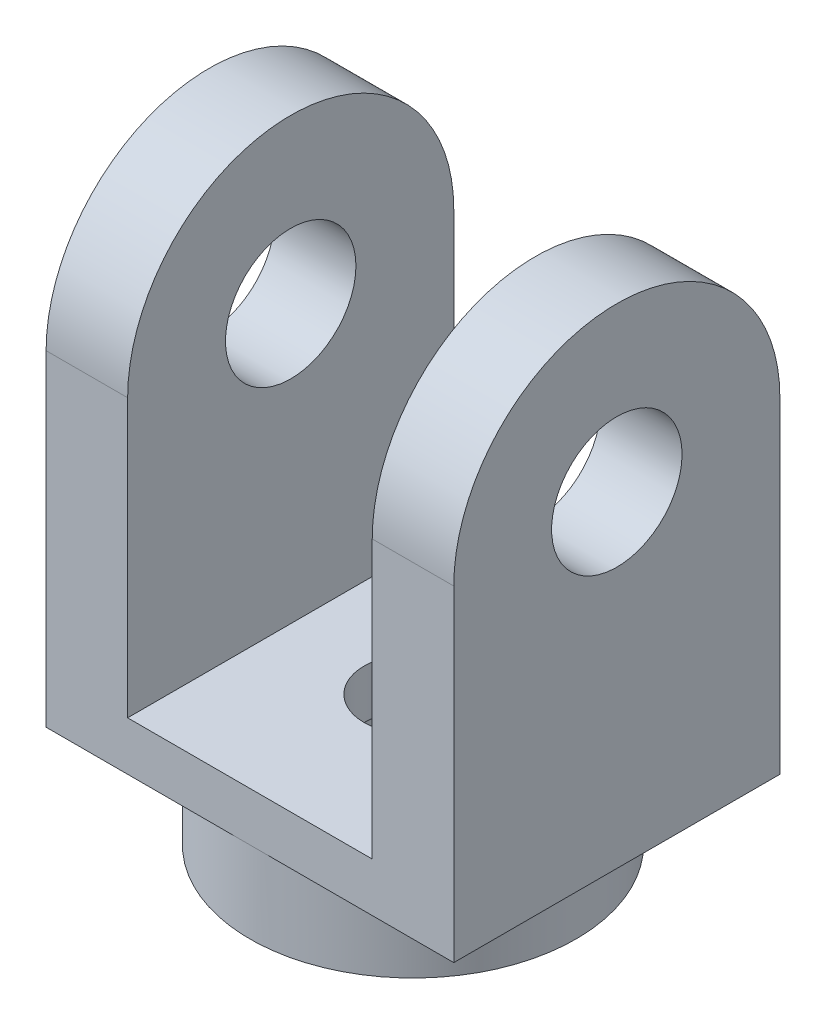
ISO-10303-21;
HEADER;
FILE_DESCRIPTION(('STEP AP214'),'2;1');
FILE_NAME('part.step','',(''),(''),'','','');
FILE_SCHEMA(('AUTOMOTIVE_DESIGN { 1 0 10303 214 1 1 1 1 }'));
ENDSEC;
DATA;
#1=APPLICATION_CONTEXT('core data for automotive mechanical design processes');
#2=APPLICATION_PROTOCOL_DEFINITION('international standard','automotive_design',2000,#1);
#3=PRODUCT_CONTEXT('',#1,'mechanical');
#4=PRODUCT('Part','Part','',(#3));
#5=PRODUCT_RELATED_PRODUCT_CATEGORY('part','',(#4));
#6=PRODUCT_DEFINITION_FORMATION('','',#4);
#7=PRODUCT_DEFINITION_CONTEXT('part definition',#1,'design');
#8=PRODUCT_DEFINITION('design','',#6,#7);
#9=PRODUCT_DEFINITION_SHAPE('','',#8);
#10=(LENGTH_UNIT() NAMED_UNIT(*) SI_UNIT(.MILLI.,.METRE.));
#11=(NAMED_UNIT(*) PLANE_ANGLE_UNIT() SI_UNIT($,.RADIAN.));
#12=(NAMED_UNIT(*) SI_UNIT($,.STERADIAN.) SOLID_ANGLE_UNIT());
#13=UNCERTAINTY_MEASURE_WITH_UNIT(LENGTH_MEASURE(1.E-05),#10,'distance_accuracy_value','');
#14=(GEOMETRIC_REPRESENTATION_CONTEXT(3) GLOBAL_UNCERTAINTY_ASSIGNED_CONTEXT((#13)) GLOBAL_UNIT_ASSIGNED_CONTEXT((#10,
#11,#12)) REPRESENTATION_CONTEXT('',''));
#15=CARTESIAN_POINT('',(0.,0.,0.));
#16=DIRECTION('',(0.,0.,1.));
#17=DIRECTION('',(1.,0.,0.));
#18=AXIS2_PLACEMENT_3D('',#15,#16,#17);
#19=CARTESIAN_POINT('',(0.,15.,0.));
#20=DIRECTION('',(0.,1.,0.));
#21=DIRECTION('',(0.,0.,1.));
#22=AXIS2_PLACEMENT_3D('',#19,#20,#21);
#23=PLANE('',#22);
#24=CARTESIAN_POINT('',(0.,15.,0.));
#25=DIRECTION('',(0.,1.,0.));
#26=DIRECTION('',(0.,0.,1.));
#27=AXIS2_PLACEMENT_3D('',#24,#25,#26);
#28=CIRCLE('',#27,15.);
#29=CARTESIAN_POINT('',(0.,15.,15.));
#30=VERTEX_POINT('',#29);
#31=EDGE_CURVE('E146',#30,#30,#28,.F.);
#32=ORIENTED_EDGE('',*,*,#31,.T.);
#33=EDGE_LOOP('',(#32));
#34=FACE_BOUND('',#33,.T.);
#35=DIRECTION('',(-1.,0.,0.));
#36=VECTOR('',#35,1.);
#37=CARTESIAN_POINT('',(-62.5,15.,-50.));
#38=LINE('',#37,#36);
#39=CARTESIAN_POINT('',(37.5,15.,-50.));
#40=VERTEX_POINT('',#39);
#41=CARTESIAN_POINT('',(-37.5,15.,-50.));
#42=VERTEX_POINT('',#41);
#43=EDGE_CURVE('E64',#40,#42,#38,.T.);
#44=ORIENTED_EDGE('',*,*,#43,.T.);
#45=DIRECTION('',(0.,0.,1.));
#46=VECTOR('',#45,1.);
#47=CARTESIAN_POINT('',(-37.5,15.,0.));
#48=LINE('',#47,#46);
#49=CARTESIAN_POINT('',(-37.5,15.,50.));
#50=VERTEX_POINT('',#49);
#51=EDGE_CURVE('E59',#42,#50,#48,.T.);
#52=ORIENTED_EDGE('',*,*,#51,.T.);
#53=DIRECTION('',(1.,0.,0.));
#54=VECTOR('',#53,1.);
#55=CARTESIAN_POINT('',(-62.5,15.,50.));
#56=LINE('',#55,#54);
#57=CARTESIAN_POINT('',(37.5,15.,50.));
#58=VERTEX_POINT('',#57);
#59=EDGE_CURVE('E213',#50,#58,#56,.T.);
#60=ORIENTED_EDGE('',*,*,#59,.T.);
#61=DIRECTION('',(0.,0.,1.));
#62=VECTOR('',#61,1.);
#63=CARTESIAN_POINT('',(37.5,15.,0.));
#64=LINE('',#63,#62);
#65=EDGE_CURVE('E170',#40,#58,#64,.T.);
#66=ORIENTED_EDGE('',*,*,#65,.F.);
#67=EDGE_LOOP('',(#44,#52,#60,#66));
#68=FACE_BOUND('',#67,.T.);
#69=ADVANCED_FACE('F41',(#34,#68),#23,.T.);
#70=CARTESIAN_POINT('',(0.,0.,0.));
#71=DIRECTION('',(0.,1.,0.));
#72=DIRECTION('',(0.,0.,1.));
#73=AXIS2_PLACEMENT_3D('',#70,#71,#72);
#74=PLANE('',#73);
#75=CARTESIAN_POINT('',(0.,0.,0.));
#76=DIRECTION('',(0.,-1.,0.));
#77=DIRECTION('',(0.,0.,-1.));
#78=AXIS2_PLACEMENT_3D('',#75,#76,#77);
#79=CIRCLE('',#78,50.);
#80=CARTESIAN_POINT('',(0.,0.,-50.));
#81=VERTEX_POINT('',#80);
#82=CARTESIAN_POINT('',(0.,0.,50.));
#83=VERTEX_POINT('',#82);
#84=EDGE_CURVE('E52',#81,#83,#79,.T.);
#85=ORIENTED_EDGE('',*,*,#84,.F.);
#86=DIRECTION('',(-1.,0.,0.));
#87=VECTOR('',#86,1.);
#88=CARTESIAN_POINT('',(-62.5,0.,-50.));
#89=LINE('',#88,#87);
#90=CARTESIAN_POINT('',(62.5,0.,-50.));
#91=VERTEX_POINT('',#90);
#92=EDGE_CURVE('E222',#91,#81,#89,.T.);
#93=ORIENTED_EDGE('',*,*,#92,.F.);
#94=DIRECTION('',(0.,0.,-1.));
#95=VECTOR('',#94,1.);
#96=CARTESIAN_POINT('',(62.5,0.,-50.));
#97=LINE('',#96,#95);
#98=CARTESIAN_POINT('',(62.5,0.,50.));
#99=VERTEX_POINT('',#98);
#100=EDGE_CURVE('E207',#99,#91,#97,.T.);
#101=ORIENTED_EDGE('',*,*,#100,.F.);
#102=DIRECTION('',(1.,0.,0.));
#103=VECTOR('',#102,1.);
#104=CARTESIAN_POINT('',(-62.5,0.,50.));
#105=LINE('',#104,#103);
#106=EDGE_CURVE('E228',#83,#99,#105,.T.);
#107=ORIENTED_EDGE('',*,*,#106,.F.);
#108=EDGE_LOOP('',(#85,#93,#101,#107));
#109=FACE_BOUND('',#108,.T.);
#110=ADVANCED_FACE('F249',(#109),#74,.F.);
#111=CARTESIAN_POINT('',(62.5,15.,-50.));
#112=DIRECTION('',(-1.,0.,0.));
#113=DIRECTION('',(0.,0.,1.));
#114=AXIS2_PLACEMENT_3D('',#111,#112,#113);
#115=PLANE('',#114);
#116=DIRECTION('',(0.,-1.,0.));
#117=VECTOR('',#116,1.);
#118=CARTESIAN_POINT('',(62.5,15.,50.));
#119=LINE('',#118,#117);
#120=CARTESIAN_POINT('',(62.5,100.,50.));
#121=VERTEX_POINT('',#120);
#122=EDGE_CURVE('E217',#121,#99,#119,.T.);
#123=ORIENTED_EDGE('',*,*,#122,.T.);
#124=ORIENTED_EDGE('',*,*,#100,.T.);
#125=DIRECTION('',(0.,-1.,0.));
#126=VECTOR('',#125,1.);
#127=CARTESIAN_POINT('',(62.5,15.,-50.));
#128=LINE('',#127,#126);
#129=CARTESIAN_POINT('',(62.5,100.,-50.));
#130=VERTEX_POINT('',#129);
#131=EDGE_CURVE('E45',#130,#91,#128,.T.);
#132=ORIENTED_EDGE('',*,*,#131,.F.);
#133=CARTESIAN_POINT('',(62.5,100.,0.));
#134=DIRECTION('',(1.,0.,0.));
#135=DIRECTION('',(0.,0.,-1.));
#136=AXIS2_PLACEMENT_3D('',#133,#134,#135);
#137=CIRCLE('',#136,50.);
#138=EDGE_CURVE('E160',#121,#130,#137,.F.);
#139=ORIENTED_EDGE('',*,*,#138,.F.);
#140=EDGE_LOOP('',(#123,#124,#132,#139));
#141=FACE_BOUND('',#140,.T.);
#142=CARTESIAN_POINT('',(62.5,100.,0.));
#143=DIRECTION('',(1.,0.,0.));
#144=DIRECTION('',(0.,0.,-1.));
#145=AXIS2_PLACEMENT_3D('',#142,#143,#144);
#146=CIRCLE('',#145,20.);
#147=CARTESIAN_POINT('',(62.5,100.,-20.));
#148=VERTEX_POINT('',#147);
#149=EDGE_CURVE('E167',#148,#148,#146,.T.);
#150=ORIENTED_EDGE('',*,*,#149,.F.);
#151=EDGE_LOOP('',(#150));
#152=FACE_BOUND('',#151,.T.);
#153=ADVANCED_FACE('F43',(#141,#152),#115,.F.);
#154=CARTESIAN_POINT('',(-62.5,15.,-50.));
#155=DIRECTION('',(0.,0.,1.));
#156=DIRECTION('',(1.,0.,0.));
#157=AXIS2_PLACEMENT_3D('',#154,#155,#156);
#158=PLANE('',#157);
#159=ORIENTED_EDGE('',*,*,#131,.T.);
#160=ORIENTED_EDGE('',*,*,#92,.T.);
#161=CARTESIAN_POINT('',(-62.5,0.,-50.));
#162=VERTEX_POINT('',#161);
#163=EDGE_CURVE('E221',#81,#162,#89,.T.);
#164=ORIENTED_EDGE('',*,*,#163,.T.);
#165=DIRECTION('',(0.,-1.,0.));
#166=VECTOR('',#165,1.);
#167=CARTESIAN_POINT('',(-62.5,15.,-50.));
#168=LINE('',#167,#166);
#169=CARTESIAN_POINT('',(-62.5,100.,-50.));
#170=VERTEX_POINT('',#169);
#171=EDGE_CURVE('E118',#170,#162,#168,.T.);
#172=ORIENTED_EDGE('',*,*,#171,.F.);
#173=DIRECTION('',(-1.,0.,0.));
#174=VECTOR('',#173,1.);
#175=CARTESIAN_POINT('',(-37.5,100.,-50.));
#176=LINE('',#175,#174);
#177=CARTESIAN_POINT('',(-37.5,100.,-50.));
#178=VERTEX_POINT('',#177);
#179=EDGE_CURVE('E113',#178,#170,#176,.T.);
#180=ORIENTED_EDGE('',*,*,#179,.F.);
#181=DIRECTION('',(0.,-1.,0.));
#182=VECTOR('',#181,1.);
#183=CARTESIAN_POINT('',(-37.5,0.,-50.));
#184=LINE('',#183,#182);
#185=EDGE_CURVE('E116',#178,#42,#184,.T.);
#186=ORIENTED_EDGE('',*,*,#185,.T.);
#187=ORIENTED_EDGE('',*,*,#43,.F.);
#188=DIRECTION('',(0.,-1.,0.));
#189=VECTOR('',#188,1.);
#190=CARTESIAN_POINT('',(37.5,0.,-50.));
#191=LINE('',#190,#189);
#192=CARTESIAN_POINT('',(37.5,100.,-50.));
#193=VERTEX_POINT('',#192);
#194=EDGE_CURVE('E174',#193,#40,#191,.T.);
#195=ORIENTED_EDGE('',*,*,#194,.F.);
#196=DIRECTION('',(1.,0.,0.));
#197=VECTOR('',#196,1.);
#198=CARTESIAN_POINT('',(37.5,100.,-50.));
#199=LINE('',#198,#197);
#200=EDGE_CURVE('E189',#193,#130,#199,.T.);
#201=ORIENTED_EDGE('',*,*,#200,.T.);
#202=EDGE_LOOP('',(#159,#160,#164,#172,#180,#186,#187,#195,#201));
#203=FACE_BOUND('',#202,.T.);
#204=ADVANCED_FACE('F115',(#203),#158,.F.);
#205=CARTESIAN_POINT('',(-62.5,15.,-50.));
#206=DIRECTION('',(1.,0.,0.));
#207=DIRECTION('',(0.,0.,-1.));
#208=AXIS2_PLACEMENT_3D('',#205,#206,#207);
#209=PLANE('',#208);
#210=DIRECTION('',(0.,0.,1.));
#211=VECTOR('',#210,1.);
#212=CARTESIAN_POINT('',(-62.5,0.,-50.));
#213=LINE('',#212,#211);
#214=CARTESIAN_POINT('',(-62.5,0.,50.));
#215=VERTEX_POINT('',#214);
#216=EDGE_CURVE('E225',#162,#215,#213,.T.);
#217=ORIENTED_EDGE('',*,*,#216,.T.);
#218=DIRECTION('',(0.,-1.,0.));
#219=VECTOR('',#218,1.);
#220=CARTESIAN_POINT('',(-62.5,15.,50.));
#221=LINE('',#220,#219);
#222=CARTESIAN_POINT('',(-62.5,100.,50.));
#223=VERTEX_POINT('',#222);
#224=EDGE_CURVE('E234',#223,#215,#221,.T.);
#225=ORIENTED_EDGE('',*,*,#224,.F.);
#226=CARTESIAN_POINT('',(-62.5,100.,0.));
#227=DIRECTION('',(1.,0.,0.));
#228=DIRECTION('',(0.,0.,-1.));
#229=AXIS2_PLACEMENT_3D('',#226,#227,#228);
#230=CIRCLE('',#229,50.);
#231=EDGE_CURVE('E143',#223,#170,#230,.F.);
#232=ORIENTED_EDGE('',*,*,#231,.T.);
#233=ORIENTED_EDGE('',*,*,#171,.T.);
#234=EDGE_LOOP('',(#217,#225,#232,#233));
#235=FACE_BOUND('',#234,.T.);
#236=CARTESIAN_POINT('',(-62.5,100.,0.));
#237=DIRECTION('',(1.,0.,0.));
#238=DIRECTION('',(0.,0.,-1.));
#239=AXIS2_PLACEMENT_3D('',#236,#237,#238);
#240=CIRCLE('',#239,20.);
#241=CARTESIAN_POINT('',(-62.5,100.,-20.));
#242=VERTEX_POINT('',#241);
#243=EDGE_CURVE('E139',#242,#242,#240,.T.);
#244=ORIENTED_EDGE('',*,*,#243,.T.);
#245=EDGE_LOOP('',(#244));
#246=FACE_BOUND('',#245,.T.);
#247=ADVANCED_FACE('F262',(#235,#246),#209,.F.);
#248=CARTESIAN_POINT('',(-62.5,15.,50.));
#249=DIRECTION('',(0.,0.,-1.));
#250=DIRECTION('',(-1.,0.,0.));
#251=AXIS2_PLACEMENT_3D('',#248,#249,#250);
#252=PLANE('',#251);
#253=DIRECTION('',(0.,1.,0.));
#254=VECTOR('',#253,1.);
#255=CARTESIAN_POINT('',(37.5,0.,50.));
#256=LINE('',#255,#254);
#257=CARTESIAN_POINT('',(37.5,100.,50.));
#258=VERTEX_POINT('',#257);
#259=EDGE_CURVE('E166',#58,#258,#256,.T.);
#260=ORIENTED_EDGE('',*,*,#259,.F.);
#261=ORIENTED_EDGE('',*,*,#59,.F.);
#262=DIRECTION('',(0.,1.,0.));
#263=VECTOR('',#262,1.);
#264=CARTESIAN_POINT('',(-37.5,0.,50.));
#265=LINE('',#264,#263);
#266=CARTESIAN_POINT('',(-37.5,100.,50.));
#267=VERTEX_POINT('',#266);
#268=EDGE_CURVE('E151',#50,#267,#265,.T.);
#269=ORIENTED_EDGE('',*,*,#268,.T.);
#270=DIRECTION('',(-1.,0.,0.));
#271=VECTOR('',#270,1.);
#272=CARTESIAN_POINT('',(-37.5,100.,50.));
#273=LINE('',#272,#271);
#274=EDGE_CURVE('E124',#267,#223,#273,.T.);
#275=ORIENTED_EDGE('',*,*,#274,.T.);
#276=ORIENTED_EDGE('',*,*,#224,.T.);
#277=EDGE_CURVE('E214',#215,#83,#105,.T.);
#278=ORIENTED_EDGE('',*,*,#277,.T.);
#279=ORIENTED_EDGE('',*,*,#106,.T.);
#280=ORIENTED_EDGE('',*,*,#122,.F.);
#281=DIRECTION('',(1.,0.,0.));
#282=VECTOR('',#281,1.);
#283=CARTESIAN_POINT('',(37.5,100.,50.));
#284=LINE('',#283,#282);
#285=EDGE_CURVE('E182',#258,#121,#284,.T.);
#286=ORIENTED_EDGE('',*,*,#285,.F.);
#287=EDGE_LOOP('',(#260,#261,#269,#275,#276,#278,#279,#280,#286));
#288=FACE_BOUND('',#287,.T.);
#289=ADVANCED_FACE('F256',(#288),#252,.F.);
#290=EDGE_CURVE('E11',#83,#81,#79,.T.);
#291=ORIENTED_EDGE('',*,*,#290,.F.);
#292=ORIENTED_EDGE('',*,*,#277,.F.);
#293=ORIENTED_EDGE('',*,*,#216,.F.);
#294=ORIENTED_EDGE('',*,*,#163,.F.);
#295=EDGE_LOOP('',(#291,#292,#293,#294));
#296=FACE_BOUND('',#295,.T.);
#297=ADVANCED_FACE('F261',(#296),#74,.F.);
#298=CARTESIAN_POINT('',(0.,-25.,0.));
#299=DIRECTION('',(0.,-1.,0.));
#300=DIRECTION('',(0.,0.,-1.));
#301=AXIS2_PLACEMENT_3D('',#298,#299,#300);
#302=PLANE('',#301);
#303=CARTESIAN_POINT('',(0.,-25.,0.));
#304=DIRECTION('',(0.,-1.,0.));
#305=DIRECTION('',(0.,0.,-1.));
#306=AXIS2_PLACEMENT_3D('',#303,#304,#305);
#307=CIRCLE('',#306,50.);
#308=CARTESIAN_POINT('',(0.,-25.,-50.));
#309=VERTEX_POINT('',#308);
#310=EDGE_CURVE('E204',#309,#309,#307,.T.);
#311=ORIENTED_EDGE('',*,*,#310,.T.);
#312=EDGE_LOOP('',(#311));
#313=FACE_BOUND('',#312,.T.);
#314=CARTESIAN_POINT('',(0.,-25.,0.));
#315=DIRECTION('',(0.,-1.,0.));
#316=DIRECTION('',(0.,0.,-1.));
#317=AXIS2_PLACEMENT_3D('',#314,#315,#316);
#318=CIRCLE('',#317,37.5);
#319=CARTESIAN_POINT('',(0.,-25.,-37.5));
#320=VERTEX_POINT('',#319);
#321=EDGE_CURVE('E197',#320,#320,#318,.T.);
#322=ORIENTED_EDGE('',*,*,#321,.F.);
#323=EDGE_LOOP('',(#322));
#324=FACE_BOUND('',#323,.T.);
#325=ADVANCED_FACE('F296',(#313,#324),#302,.T.);
#326=CARTESIAN_POINT('',(0.,-25.,0.));
#327=DIRECTION('',(0.,1.,0.));
#328=DIRECTION('',(0.,0.,1.));
#329=AXIS2_PLACEMENT_3D('',#326,#327,#328);
#330=CYLINDRICAL_SURFACE('',#329,50.);
#331=ORIENTED_EDGE('',*,*,#310,.F.);
#332=EDGE_LOOP('',(#331));
#333=FACE_BOUND('',#332,.T.);
#334=ORIENTED_EDGE('',*,*,#84,.T.);
#335=ORIENTED_EDGE('',*,*,#290,.T.);
#336=EDGE_LOOP('',(#334,#335));
#337=FACE_BOUND('',#336,.T.);
#338=ADVANCED_FACE('F292',(#333,#337),#330,.T.);
#339=CARTESIAN_POINT('',(0.,-25.,0.));
#340=DIRECTION('',(0.,1.,0.));
#341=DIRECTION('',(0.,0.,1.));
#342=AXIS2_PLACEMENT_3D('',#339,#340,#341);
#343=CYLINDRICAL_SURFACE('',#342,37.5);
#344=ORIENTED_EDGE('',*,*,#321,.T.);
#345=EDGE_LOOP('',(#344));
#346=FACE_BOUND('',#345,.T.);
#347=CARTESIAN_POINT('',(0.,0.,0.));
#348=DIRECTION('',(0.,-1.,0.));
#349=DIRECTION('',(0.,0.,-1.));
#350=AXIS2_PLACEMENT_3D('',#347,#348,#349);
#351=CIRCLE('',#350,37.5);
#352=CARTESIAN_POINT('',(0.,0.,-37.5));
#353=VERTEX_POINT('',#352);
#354=EDGE_CURVE('E193',#353,#353,#351,.T.);
#355=ORIENTED_EDGE('',*,*,#354,.F.);
#356=EDGE_LOOP('',(#355));
#357=FACE_BOUND('',#356,.T.);
#358=ADVANCED_FACE('F280',(#346,#357),#343,.F.);
#359=CARTESIAN_POINT('',(0.,0.,0.));
#360=DIRECTION('',(0.,-1.,0.));
#361=DIRECTION('',(0.,0.,-1.));
#362=AXIS2_PLACEMENT_3D('',#359,#360,#361);
#363=CIRCLE('',#362,15.);
#364=CARTESIAN_POINT('',(0.,0.,-15.));
#365=VERTEX_POINT('',#364);
#366=EDGE_CURVE('E447',#365,#365,#363,.T.);
#367=ORIENTED_EDGE('',*,*,#366,.F.);
#368=EDGE_LOOP('',(#367));
#369=FACE_BOUND('',#368,.T.);
#370=ORIENTED_EDGE('',*,*,#354,.T.);
#371=EDGE_LOOP('',(#370));
#372=FACE_BOUND('',#371,.T.);
#373=ADVANCED_FACE('F272',(#369,#372),#74,.F.);
#374=CARTESIAN_POINT('',(37.5,100.,0.));
#375=DIRECTION('',(1.,0.,0.));
#376=DIRECTION('',(0.,0.,-1.));
#377=AXIS2_PLACEMENT_3D('',#374,#375,#376);
#378=CYLINDRICAL_SURFACE('',#377,50.);
#379=ORIENTED_EDGE('',*,*,#138,.T.);
#380=ORIENTED_EDGE('',*,*,#200,.F.);
#381=CARTESIAN_POINT('',(37.5,100.,0.));
#382=DIRECTION('',(1.,0.,0.));
#383=DIRECTION('',(0.,0.,-1.));
#384=AXIS2_PLACEMENT_3D('',#381,#382,#383);
#385=CIRCLE('',#384,50.);
#386=EDGE_CURVE('E162',#258,#193,#385,.F.);
#387=ORIENTED_EDGE('',*,*,#386,.F.);
#388=ORIENTED_EDGE('',*,*,#285,.T.);
#389=EDGE_LOOP('',(#379,#380,#387,#388));
#390=FACE_BOUND('',#389,.T.);
#391=ADVANCED_FACE('F269',(#390),#378,.T.);
#392=CARTESIAN_POINT('',(37.5,100.,0.));
#393=DIRECTION('',(1.,0.,0.));
#394=DIRECTION('',(0.,0.,-1.));
#395=AXIS2_PLACEMENT_3D('',#392,#393,#394);
#396=CYLINDRICAL_SURFACE('',#395,20.);
#397=CARTESIAN_POINT('',(37.5,100.,0.));
#398=DIRECTION('',(1.,0.,0.));
#399=DIRECTION('',(0.,0.,-1.));
#400=AXIS2_PLACEMENT_3D('',#397,#398,#399);
#401=CIRCLE('',#400,20.);
#402=CARTESIAN_POINT('',(37.5,100.,-20.));
#403=VERTEX_POINT('',#402);
#404=EDGE_CURVE('E178',#403,#403,#401,.T.);
#405=ORIENTED_EDGE('',*,*,#404,.F.);
#406=EDGE_LOOP('',(#405));
#407=FACE_BOUND('',#406,.T.);
#408=ORIENTED_EDGE('',*,*,#149,.T.);
#409=EDGE_LOOP('',(#408));
#410=FACE_BOUND('',#409,.T.);
#411=ADVANCED_FACE('F271',(#407,#410),#396,.F.);
#412=CARTESIAN_POINT('',(37.5,0.,0.));
#413=DIRECTION('',(1.,0.,0.));
#414=DIRECTION('',(0.,0.,-1.));
#415=AXIS2_PLACEMENT_3D('',#412,#413,#414);
#416=PLANE('',#415);
#417=ORIENTED_EDGE('',*,*,#386,.T.);
#418=ORIENTED_EDGE('',*,*,#194,.T.);
#419=ORIENTED_EDGE('',*,*,#65,.T.);
#420=ORIENTED_EDGE('',*,*,#259,.T.);
#421=EDGE_LOOP('',(#417,#418,#419,#420));
#422=FACE_BOUND('',#421,.T.);
#423=ORIENTED_EDGE('',*,*,#404,.T.);
#424=EDGE_LOOP('',(#423));
#425=FACE_BOUND('',#424,.T.);
#426=ADVANCED_FACE('F265',(#422,#425),#416,.F.);
#427=CARTESIAN_POINT('',(-37.5,100.,0.));
#428=DIRECTION('',(-1.,0.,0.));
#429=DIRECTION('',(0.,0.,1.));
#430=AXIS2_PLACEMENT_3D('',#427,#428,#429);
#431=CYLINDRICAL_SURFACE('',#430,50.);
#432=ORIENTED_EDGE('',*,*,#231,.F.);
#433=ORIENTED_EDGE('',*,*,#274,.F.);
#434=CARTESIAN_POINT('',(-37.5,100.,0.));
#435=DIRECTION('',(1.,0.,0.));
#436=DIRECTION('',(0.,0.,-1.));
#437=AXIS2_PLACEMENT_3D('',#434,#435,#436);
#438=CIRCLE('',#437,50.);
#439=EDGE_CURVE('E132',#267,#178,#438,.F.);
#440=ORIENTED_EDGE('',*,*,#439,.T.);
#441=ORIENTED_EDGE('',*,*,#179,.T.);
#442=EDGE_LOOP('',(#432,#433,#440,#441));
#443=FACE_BOUND('',#442,.T.);
#444=ADVANCED_FACE('F136',(#443),#431,.T.);
#445=CARTESIAN_POINT('',(-37.5,100.,0.));
#446=DIRECTION('',(-1.,0.,0.));
#447=DIRECTION('',(0.,0.,1.));
#448=AXIS2_PLACEMENT_3D('',#445,#446,#447);
#449=CYLINDRICAL_SURFACE('',#448,20.);
#450=CARTESIAN_POINT('',(-37.5,100.,0.));
#451=DIRECTION('',(1.,0.,0.));
#452=DIRECTION('',(0.,0.,-1.));
#453=AXIS2_PLACEMENT_3D('',#450,#451,#452);
#454=CIRCLE('',#453,20.);
#455=CARTESIAN_POINT('',(-37.5,100.,-20.));
#456=VERTEX_POINT('',#455);
#457=EDGE_CURVE('E125',#456,#456,#454,.T.);
#458=ORIENTED_EDGE('',*,*,#457,.T.);
#459=EDGE_LOOP('',(#458));
#460=FACE_BOUND('',#459,.T.);
#461=ORIENTED_EDGE('',*,*,#243,.F.);
#462=EDGE_LOOP('',(#461));
#463=FACE_BOUND('',#462,.T.);
#464=ADVANCED_FACE('F370',(#460,#463),#449,.F.);
#465=CARTESIAN_POINT('',(-37.5,0.,0.));
#466=DIRECTION('',(-1.,0.,0.));
#467=DIRECTION('',(0.,0.,-1.));
#468=AXIS2_PLACEMENT_3D('',#465,#466,#467);
#469=PLANE('',#468);
#470=ORIENTED_EDGE('',*,*,#439,.F.);
#471=ORIENTED_EDGE('',*,*,#268,.F.);
#472=ORIENTED_EDGE('',*,*,#51,.F.);
#473=ORIENTED_EDGE('',*,*,#185,.F.);
#474=EDGE_LOOP('',(#470,#471,#472,#473));
#475=FACE_BOUND('',#474,.T.);
#476=ORIENTED_EDGE('',*,*,#457,.F.);
#477=EDGE_LOOP('',(#476));
#478=FACE_BOUND('',#477,.T.);
#479=ADVANCED_FACE('F129',(#475,#478),#469,.F.);
#480=CARTESIAN_POINT('',(0.,57.4264068711929,0.));
#481=DIRECTION('',(0.,-1.,0.));
#482=DIRECTION('',(0.,0.,-1.));
#483=AXIS2_PLACEMENT_3D('',#480,#481,#482);
#484=CYLINDRICAL_SURFACE('',#483,15.);
#485=ORIENTED_EDGE('',*,*,#366,.T.);
#486=EDGE_LOOP('',(#485));
#487=FACE_BOUND('',#486,.T.);
#488=ORIENTED_EDGE('',*,*,#31,.F.);
#489=EDGE_LOOP('',(#488));
#490=FACE_BOUND('',#489,.T.);
#491=ADVANCED_FACE('F385',(#487,#490),#484,.F.);
#492=CLOSED_SHELL('',(#69,#110,#153,#204,#247,#289,#297,#325,#338,#358,#373,#391,#411,#426,#444,
#464,#479,#491));
#493=MANIFOLD_SOLID_BREP('B2',#492);
#494=ADVANCED_BREP_SHAPE_REPRESENTATION('',(#18,#493),#14);
#495=SHAPE_DEFINITION_REPRESENTATION(#9,#494);
ENDSEC;
END-ISO-10303-21;
